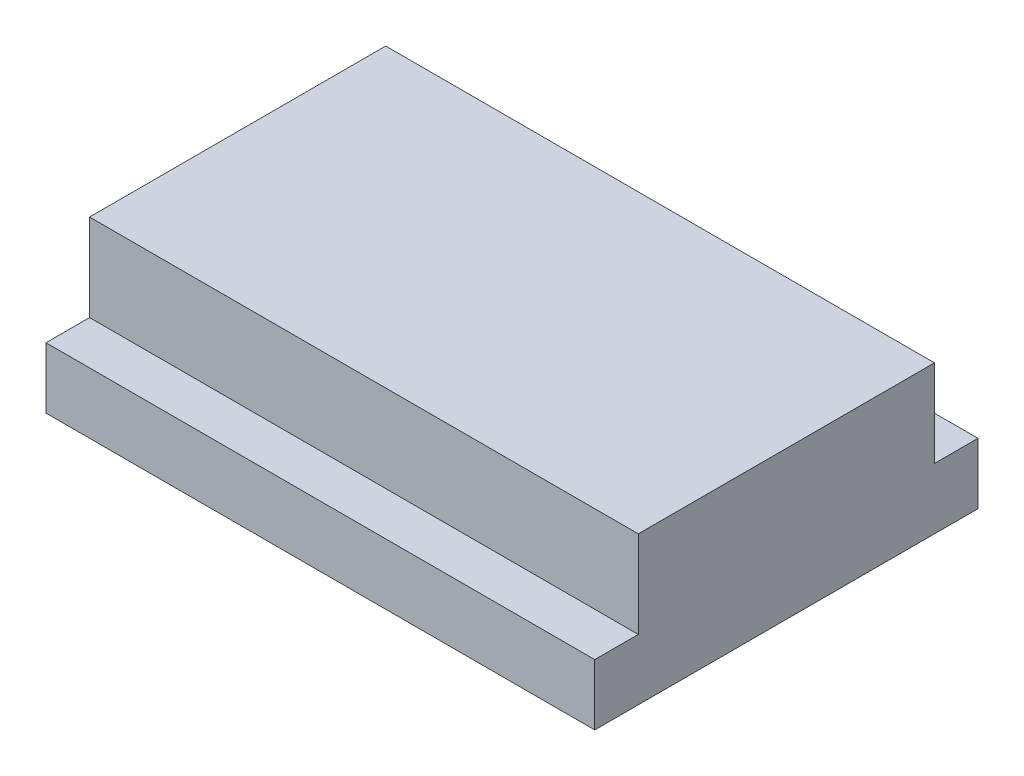
ISO-10303-21;
HEADER;
FILE_DESCRIPTION(('STEP AP214'),'2;1');
FILE_NAME('part.step','',(''),(''),'','','');
FILE_SCHEMA(('AUTOMOTIVE_DESIGN { 1 0 10303 214 1 1 1 1 }'));
ENDSEC;
DATA;
#1=APPLICATION_CONTEXT('core data for automotive mechanical design processes');
#2=APPLICATION_PROTOCOL_DEFINITION('international standard','automotive_design',2000,#1);
#3=PRODUCT_CONTEXT('',#1,'mechanical');
#4=PRODUCT('Part','Part','',(#3));
#5=PRODUCT_RELATED_PRODUCT_CATEGORY('part','',(#4));
#6=PRODUCT_DEFINITION_FORMATION('','',#4);
#7=PRODUCT_DEFINITION_CONTEXT('part definition',#1,'design');
#8=PRODUCT_DEFINITION('design','',#6,#7);
#9=PRODUCT_DEFINITION_SHAPE('','',#8);
#10=(LENGTH_UNIT() NAMED_UNIT(*) SI_UNIT(.MILLI.,.METRE.));
#11=(NAMED_UNIT(*) PLANE_ANGLE_UNIT() SI_UNIT($,.RADIAN.));
#12=(NAMED_UNIT(*) SI_UNIT($,.STERADIAN.) SOLID_ANGLE_UNIT());
#13=UNCERTAINTY_MEASURE_WITH_UNIT(LENGTH_MEASURE(1.E-05),#10,'distance_accuracy_value','');
#14=(GEOMETRIC_REPRESENTATION_CONTEXT(3) GLOBAL_UNCERTAINTY_ASSIGNED_CONTEXT((#13)) GLOBAL_UNIT_ASSIGNED_CONTEXT((#10,
#11,#12)) REPRESENTATION_CONTEXT('',''));
#15=CARTESIAN_POINT('',(0.,0.,0.));
#16=DIRECTION('',(0.,0.,1.));
#17=DIRECTION('',(1.,0.,0.));
#18=AXIS2_PLACEMENT_3D('',#15,#16,#17);
#19=CARTESIAN_POINT('',(-31.5,17.,-22.));
#20=DIRECTION('',(0.,0.,1.));
#21=DIRECTION('',(1.,0.,0.));
#22=AXIS2_PLACEMENT_3D('',#19,#20,#21);
#23=PLANE('',#22);
#24=DIRECTION('',(-1.,0.,0.));
#25=VECTOR('',#24,1.);
#26=CARTESIAN_POINT('',(-31.5,7.,-22.));
#27=LINE('',#26,#25);
#28=CARTESIAN_POINT('',(31.5,7.,-22.));
#29=VERTEX_POINT('',#28);
#30=CARTESIAN_POINT('',(-31.5,7.,-22.));
#31=VERTEX_POINT('',#30);
#32=EDGE_CURVE('E146',#29,#31,#27,.T.);
#33=ORIENTED_EDGE('',*,*,#32,.F.);
#34=DIRECTION('',(0.,-1.,0.));
#35=VECTOR('',#34,1.);
#36=CARTESIAN_POINT('',(31.5,17.,-22.));
#37=LINE('',#36,#35);
#38=CARTESIAN_POINT('',(31.5,0.,-22.));
#39=VERTEX_POINT('',#38);
#40=EDGE_CURVE('E11',#29,#39,#37,.T.);
#41=ORIENTED_EDGE('',*,*,#40,.T.);
#42=DIRECTION('',(-1.,0.,0.));
#43=VECTOR('',#42,1.);
#44=CARTESIAN_POINT('',(-31.5,0.,-22.));
#45=LINE('',#44,#43);
#46=CARTESIAN_POINT('',(-31.5,0.,-22.));
#47=VERTEX_POINT('',#46);
#48=EDGE_CURVE('E135',#39,#47,#45,.T.);
#49=ORIENTED_EDGE('',*,*,#48,.T.);
#50=DIRECTION('',(0.,-1.,0.));
#51=VECTOR('',#50,1.);
#52=CARTESIAN_POINT('',(-31.5,17.,-22.));
#53=LINE('',#52,#51);
#54=EDGE_CURVE('E45',#31,#47,#53,.T.);
#55=ORIENTED_EDGE('',*,*,#54,.F.);
#56=EDGE_LOOP('',(#33,#41,#49,#55));
#57=FACE_BOUND('',#56,.T.);
#58=ADVANCED_FACE('F37',(#57),#23,.F.);
#59=CARTESIAN_POINT('',(31.5,17.,-22.));
#60=DIRECTION('',(-1.,0.,0.));
#61=DIRECTION('',(0.,0.,1.));
#62=AXIS2_PLACEMENT_3D('',#59,#60,#61);
#63=PLANE('',#62);
#64=DIRECTION('',(0.,0.,-1.));
#65=VECTOR('',#64,1.);
#66=CARTESIAN_POINT('',(31.5,17.,-22.));
#67=LINE('',#66,#65);
#68=CARTESIAN_POINT('',(31.5,17.,17.));
#69=VERTEX_POINT('',#68);
#70=CARTESIAN_POINT('',(31.5,17.,-17.));
#71=VERTEX_POINT('',#70);
#72=EDGE_CURVE('E133',#69,#71,#67,.T.);
#73=ORIENTED_EDGE('',*,*,#72,.F.);
#74=DIRECTION('',(0.,1.,0.));
#75=VECTOR('',#74,1.);
#76=CARTESIAN_POINT('',(31.5,7.,17.));
#77=LINE('',#76,#75);
#78=CARTESIAN_POINT('',(31.5,7.,17.));
#79=VERTEX_POINT('',#78);
#80=EDGE_CURVE('E52',#79,#69,#77,.T.);
#81=ORIENTED_EDGE('',*,*,#80,.F.);
#82=DIRECTION('',(0.,0.,-1.));
#83=VECTOR('',#82,1.);
#84=CARTESIAN_POINT('',(31.5,7.,22.));
#85=LINE('',#84,#83);
#86=CARTESIAN_POINT('',(31.5,7.,22.));
#87=VERTEX_POINT('',#86);
#88=EDGE_CURVE('E121',#87,#79,#85,.T.);
#89=ORIENTED_EDGE('',*,*,#88,.F.);
#90=DIRECTION('',(0.,-1.,0.));
#91=VECTOR('',#90,1.);
#92=CARTESIAN_POINT('',(31.5,17.,22.));
#93=LINE('',#92,#91);
#94=CARTESIAN_POINT('',(31.5,0.,22.));
#95=VERTEX_POINT('',#94);
#96=EDGE_CURVE('E120',#87,#95,#93,.T.);
#97=ORIENTED_EDGE('',*,*,#96,.T.);
#98=DIRECTION('',(0.,0.,-1.));
#99=VECTOR('',#98,1.);
#100=CARTESIAN_POINT('',(31.5,0.,-22.));
#101=LINE('',#100,#99);
#102=EDGE_CURVE('E138',#95,#39,#101,.T.);
#103=ORIENTED_EDGE('',*,*,#102,.T.);
#104=ORIENTED_EDGE('',*,*,#40,.F.);
#105=DIRECTION('',(0.,0.,-1.));
#106=VECTOR('',#105,1.);
#107=CARTESIAN_POINT('',(31.5,7.,-22.));
#108=LINE('',#107,#106);
#109=CARTESIAN_POINT('',(31.5,7.,-17.));
#110=VERTEX_POINT('',#109);
#111=EDGE_CURVE('E154',#110,#29,#108,.T.);
#112=ORIENTED_EDGE('',*,*,#111,.F.);
#113=DIRECTION('',(0.,1.,0.));
#114=VECTOR('',#113,1.);
#115=CARTESIAN_POINT('',(31.5,7.,-17.));
#116=LINE('',#115,#114);
#117=EDGE_CURVE('E141',#110,#71,#116,.T.);
#118=ORIENTED_EDGE('',*,*,#117,.T.);
#119=EDGE_LOOP('',(#73,#81,#89,#97,#103,#104,#112,#118));
#120=FACE_BOUND('',#119,.T.);
#121=ADVANCED_FACE('F39',(#120),#63,.F.);
#122=CARTESIAN_POINT('',(-31.5,17.,-22.));
#123=DIRECTION('',(1.,0.,0.));
#124=DIRECTION('',(0.,0.,-1.));
#125=AXIS2_PLACEMENT_3D('',#122,#123,#124);
#126=PLANE('',#125);
#127=DIRECTION('',(0.,0.,1.));
#128=VECTOR('',#127,1.);
#129=CARTESIAN_POINT('',(-31.5,7.,22.));
#130=LINE('',#129,#128);
#131=CARTESIAN_POINT('',(-31.5,7.,17.));
#132=VERTEX_POINT('',#131);
#133=CARTESIAN_POINT('',(-31.5,7.,22.));
#134=VERTEX_POINT('',#133);
#135=EDGE_CURVE('E103',#132,#134,#130,.T.);
#136=ORIENTED_EDGE('',*,*,#135,.F.);
#137=DIRECTION('',(0.,1.,0.));
#138=VECTOR('',#137,1.);
#139=CARTESIAN_POINT('',(-31.5,7.,17.));
#140=LINE('',#139,#138);
#141=CARTESIAN_POINT('',(-31.5,17.,17.));
#142=VERTEX_POINT('',#141);
#143=EDGE_CURVE('E152',#132,#142,#140,.T.);
#144=ORIENTED_EDGE('',*,*,#143,.T.);
#145=DIRECTION('',(0.,0.,1.));
#146=VECTOR('',#145,1.);
#147=CARTESIAN_POINT('',(-31.5,17.,-22.));
#148=LINE('',#147,#146);
#149=CARTESIAN_POINT('',(-31.5,17.,-17.));
#150=VERTEX_POINT('',#149);
#151=EDGE_CURVE('E128',#150,#142,#148,.T.);
#152=ORIENTED_EDGE('',*,*,#151,.F.);
#153=DIRECTION('',(0.,1.,0.));
#154=VECTOR('',#153,1.);
#155=CARTESIAN_POINT('',(-31.5,7.,-17.));
#156=LINE('',#155,#154);
#157=CARTESIAN_POINT('',(-31.5,7.,-17.));
#158=VERTEX_POINT('',#157);
#159=EDGE_CURVE('E60',#158,#150,#156,.T.);
#160=ORIENTED_EDGE('',*,*,#159,.F.);
#161=DIRECTION('',(0.,0.,1.));
#162=VECTOR('',#161,1.);
#163=CARTESIAN_POINT('',(-31.5,7.,-22.));
#164=LINE('',#163,#162);
#165=EDGE_CURVE('E151',#31,#158,#164,.T.);
#166=ORIENTED_EDGE('',*,*,#165,.F.);
#167=ORIENTED_EDGE('',*,*,#54,.T.);
#168=DIRECTION('',(0.,0.,1.));
#169=VECTOR('',#168,1.);
#170=CARTESIAN_POINT('',(-31.5,0.,-22.));
#171=LINE('',#170,#169);
#172=CARTESIAN_POINT('',(-31.5,0.,22.));
#173=VERTEX_POINT('',#172);
#174=EDGE_CURVE('E125',#47,#173,#171,.T.);
#175=ORIENTED_EDGE('',*,*,#174,.T.);
#176=DIRECTION('',(0.,-1.,0.));
#177=VECTOR('',#176,1.);
#178=CARTESIAN_POINT('',(-31.5,17.,22.));
#179=LINE('',#178,#177);
#180=EDGE_CURVE('E118',#134,#173,#179,.T.);
#181=ORIENTED_EDGE('',*,*,#180,.F.);
#182=EDGE_LOOP('',(#136,#144,#152,#160,#166,#167,#175,#181));
#183=FACE_BOUND('',#182,.T.);
#184=ADVANCED_FACE('F123',(#183),#126,.F.);
#185=CARTESIAN_POINT('',(-31.5,17.,22.));
#186=DIRECTION('',(0.,0.,-1.));
#187=DIRECTION('',(-1.,0.,0.));
#188=AXIS2_PLACEMENT_3D('',#185,#186,#187);
#189=PLANE('',#188);
#190=ORIENTED_EDGE('',*,*,#96,.F.);
#191=DIRECTION('',(1.,0.,0.));
#192=VECTOR('',#191,1.);
#193=CARTESIAN_POINT('',(-31.5,7.,22.));
#194=LINE('',#193,#192);
#195=EDGE_CURVE('E106',#134,#87,#194,.T.);
#196=ORIENTED_EDGE('',*,*,#195,.F.);
#197=ORIENTED_EDGE('',*,*,#180,.T.);
#198=DIRECTION('',(1.,0.,0.));
#199=VECTOR('',#198,1.);
#200=CARTESIAN_POINT('',(-31.5,0.,22.));
#201=LINE('',#200,#199);
#202=EDGE_CURVE('E131',#173,#95,#201,.T.);
#203=ORIENTED_EDGE('',*,*,#202,.T.);
#204=EDGE_LOOP('',(#190,#196,#197,#203));
#205=FACE_BOUND('',#204,.T.);
#206=ADVANCED_FACE('F116',(#205),#189,.F.);
#207=CARTESIAN_POINT('',(0.,17.,0.));
#208=DIRECTION('',(0.,1.,0.));
#209=DIRECTION('',(0.,0.,1.));
#210=AXIS2_PLACEMENT_3D('',#207,#208,#209);
#211=PLANE('',#210);
#212=DIRECTION('',(-1.,0.,0.));
#213=VECTOR('',#212,1.);
#214=CARTESIAN_POINT('',(-31.5,17.,17.));
#215=LINE('',#214,#213);
#216=EDGE_CURVE('E112',#69,#142,#215,.T.);
#217=ORIENTED_EDGE('',*,*,#216,.F.);
#218=ORIENTED_EDGE('',*,*,#72,.T.);
#219=DIRECTION('',(1.,0.,0.));
#220=VECTOR('',#219,1.);
#221=CARTESIAN_POINT('',(-31.5,17.,-17.));
#222=LINE('',#221,#220);
#223=EDGE_CURVE('E149',#150,#71,#222,.T.);
#224=ORIENTED_EDGE('',*,*,#223,.F.);
#225=ORIENTED_EDGE('',*,*,#151,.T.);
#226=EDGE_LOOP('',(#217,#218,#224,#225));
#227=FACE_BOUND('',#226,.T.);
#228=ADVANCED_FACE('F170',(#227),#211,.T.);
#229=CARTESIAN_POINT('',(0.,0.,0.));
#230=DIRECTION('',(0.,1.,0.));
#231=DIRECTION('',(0.,0.,1.));
#232=AXIS2_PLACEMENT_3D('',#229,#230,#231);
#233=PLANE('',#232);
#234=ORIENTED_EDGE('',*,*,#102,.F.);
#235=ORIENTED_EDGE('',*,*,#202,.F.);
#236=ORIENTED_EDGE('',*,*,#174,.F.);
#237=ORIENTED_EDGE('',*,*,#48,.F.);
#238=EDGE_LOOP('',(#234,#235,#236,#237));
#239=FACE_BOUND('',#238,.T.);
#240=ADVANCED_FACE('F183',(#239),#233,.F.);
#241=CARTESIAN_POINT('',(-31.5,7.,-17.));
#242=DIRECTION('',(0.,0.,1.));
#243=DIRECTION('',(1.,0.,0.));
#244=AXIS2_PLACEMENT_3D('',#241,#242,#243);
#245=PLANE('',#244);
#246=ORIENTED_EDGE('',*,*,#223,.T.);
#247=ORIENTED_EDGE('',*,*,#117,.F.);
#248=DIRECTION('',(1.,0.,0.));
#249=VECTOR('',#248,1.);
#250=CARTESIAN_POINT('',(-31.5,7.,-17.));
#251=LINE('',#250,#249);
#252=EDGE_CURVE('E156',#158,#110,#251,.T.);
#253=ORIENTED_EDGE('',*,*,#252,.F.);
#254=ORIENTED_EDGE('',*,*,#159,.T.);
#255=EDGE_LOOP('',(#246,#247,#253,#254));
#256=FACE_BOUND('',#255,.T.);
#257=ADVANCED_FACE('F172',(#256),#245,.F.);
#258=CARTESIAN_POINT('',(0.,7.,0.));
#259=DIRECTION('',(0.,1.,0.));
#260=DIRECTION('',(0.,0.,1.));
#261=AXIS2_PLACEMENT_3D('',#258,#259,#260);
#262=PLANE('',#261);
#263=ORIENTED_EDGE('',*,*,#165,.T.);
#264=ORIENTED_EDGE('',*,*,#252,.T.);
#265=ORIENTED_EDGE('',*,*,#111,.T.);
#266=ORIENTED_EDGE('',*,*,#32,.T.);
#267=EDGE_LOOP('',(#263,#264,#265,#266));
#268=FACE_BOUND('',#267,.T.);
#269=ADVANCED_FACE('F174',(#268),#262,.T.);
#270=CARTESIAN_POINT('',(-31.5,7.,17.));
#271=DIRECTION('',(0.,0.,-1.));
#272=DIRECTION('',(-1.,0.,0.));
#273=AXIS2_PLACEMENT_3D('',#270,#271,#272);
#274=PLANE('',#273);
#275=ORIENTED_EDGE('',*,*,#216,.T.);
#276=ORIENTED_EDGE('',*,*,#143,.F.);
#277=DIRECTION('',(-1.,0.,0.));
#278=VECTOR('',#277,1.);
#279=CARTESIAN_POINT('',(-31.5,7.,17.));
#280=LINE('',#279,#278);
#281=EDGE_CURVE('E108',#79,#132,#280,.T.);
#282=ORIENTED_EDGE('',*,*,#281,.F.);
#283=ORIENTED_EDGE('',*,*,#80,.T.);
#284=EDGE_LOOP('',(#275,#276,#282,#283));
#285=FACE_BOUND('',#284,.T.);
#286=ADVANCED_FACE('F166',(#285),#274,.F.);
#287=CARTESIAN_POINT('',(0.,7.,0.));
#288=DIRECTION('',(0.,-1.,0.));
#289=DIRECTION('',(0.,0.,-1.));
#290=AXIS2_PLACEMENT_3D('',#287,#288,#289);
#291=PLANE('',#290);
#292=ORIENTED_EDGE('',*,*,#135,.T.);
#293=ORIENTED_EDGE('',*,*,#195,.T.);
#294=ORIENTED_EDGE('',*,*,#88,.T.);
#295=ORIENTED_EDGE('',*,*,#281,.T.);
#296=EDGE_LOOP('',(#292,#293,#294,#295));
#297=FACE_BOUND('',#296,.T.);
#298=ADVANCED_FACE('F105',(#297),#291,.F.);
#299=CLOSED_SHELL('',(#58,#121,#184,#206,#228,#240,#257,#269,#286,#298));
#300=MANIFOLD_SOLID_BREP('B2',#299);
#301=ADVANCED_BREP_SHAPE_REPRESENTATION('',(#18,#300),#14);
#302=SHAPE_DEFINITION_REPRESENTATION(#9,#301);
ENDSEC;
END-ISO-10303-21;
